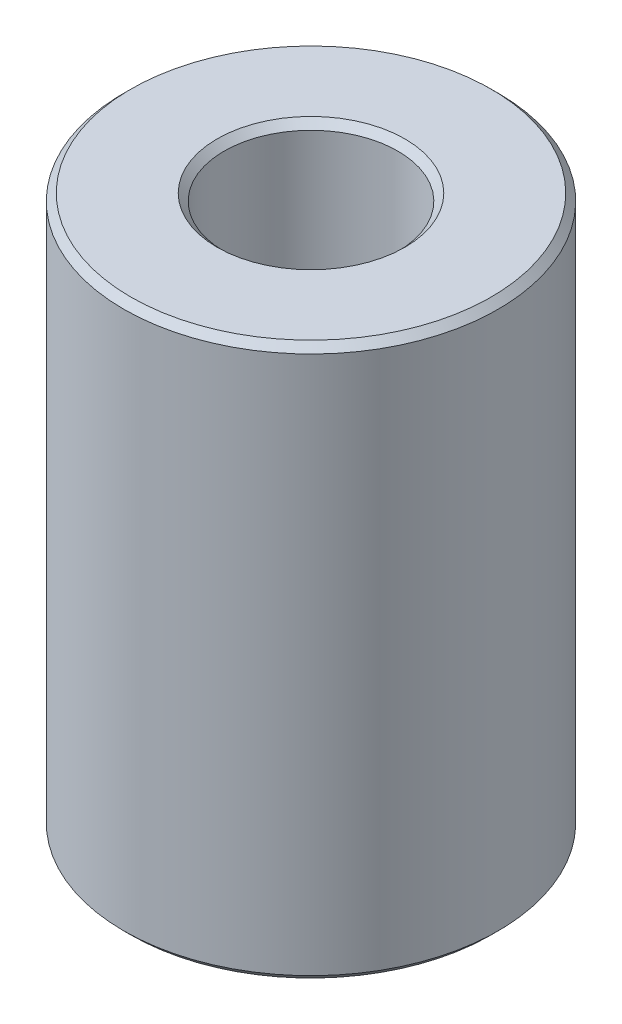
ISO-10303-21;
HEADER;
FILE_DESCRIPTION(('STEP AP214'),'2;1');
FILE_NAME('part.step','',(''),(''),'','','');
FILE_SCHEMA(('AUTOMOTIVE_DESIGN { 1 0 10303 214 1 1 1 1 }'));
ENDSEC;
DATA;
#1=APPLICATION_CONTEXT('core data for automotive mechanical design processes');
#2=APPLICATION_PROTOCOL_DEFINITION('international standard','automotive_design',2000,#1);
#3=PRODUCT_CONTEXT('',#1,'mechanical');
#4=PRODUCT('Part','Part','',(#3));
#5=PRODUCT_RELATED_PRODUCT_CATEGORY('part','',(#4));
#6=PRODUCT_DEFINITION_FORMATION('','',#4);
#7=PRODUCT_DEFINITION_CONTEXT('part definition',#1,'design');
#8=PRODUCT_DEFINITION('design','',#6,#7);
#9=PRODUCT_DEFINITION_SHAPE('','',#8);
#10=(LENGTH_UNIT() NAMED_UNIT(*) SI_UNIT(.MILLI.,.METRE.));
#11=(NAMED_UNIT(*) PLANE_ANGLE_UNIT() SI_UNIT($,.RADIAN.));
#12=(NAMED_UNIT(*) SI_UNIT($,.STERADIAN.) SOLID_ANGLE_UNIT());
#13=UNCERTAINTY_MEASURE_WITH_UNIT(LENGTH_MEASURE(1.E-05),#10,'distance_accuracy_value','');
#14=(GEOMETRIC_REPRESENTATION_CONTEXT(3) GLOBAL_UNCERTAINTY_ASSIGNED_CONTEXT((#13)) GLOBAL_UNIT_ASSIGNED_CONTEXT((#10,
#11,#12)) REPRESENTATION_CONTEXT('',''));
#15=CARTESIAN_POINT('',(0.,0.,0.));
#16=DIRECTION('',(0.,0.,1.));
#17=DIRECTION('',(1.,0.,0.));
#18=AXIS2_PLACEMENT_3D('',#15,#16,#17);
#19=CARTESIAN_POINT('',(0.,140.190415541771,0.));
#20=DIRECTION('',(0.,-1.,0.));
#21=DIRECTION('',(0.,0.,-1.));
#22=AXIS2_PLACEMENT_3D('',#19,#20,#21);
#23=CYLINDRICAL_SURFACE('',#22,47.5);
#24=CARTESIAN_POINT('',(0.,1.78519421544657,0.));
#25=DIRECTION('',(0.,1.,0.));
#26=DIRECTION('',(0.,0.,1.));
#27=AXIS2_PLACEMENT_3D('',#24,#25,#26);
#28=CIRCLE('',#27,47.5);
#29=CARTESIAN_POINT('',(0.,1.78519421544657,47.5));
#30=VERTEX_POINT('',#29);
#31=EDGE_CURVE('E10',#30,#30,#28,.T.);
#32=ORIENTED_EDGE('',*,*,#31,.T.);
#33=EDGE_LOOP('',(#32));
#34=FACE_BOUND('',#33,.T.);
#35=CARTESIAN_POINT('',(0.,138.405221326324,0.));
#36=DIRECTION('',(0.,1.,0.));
#37=DIRECTION('',(0.,0.,1.));
#38=AXIS2_PLACEMENT_3D('',#35,#36,#37);
#39=CIRCLE('',#38,47.5);
#40=CARTESIAN_POINT('',(0.,138.405221326324,47.5));
#41=VERTEX_POINT('',#40);
#42=EDGE_CURVE('E50',#41,#41,#39,.F.);
#43=ORIENTED_EDGE('',*,*,#42,.T.);
#44=EDGE_LOOP('',(#43));
#45=FACE_BOUND('',#44,.T.);
#46=ADVANCED_FACE('F39',(#34,#45),#23,.T.);
#47=CARTESIAN_POINT('',(0.,140.190415541771,0.));
#48=DIRECTION('',(0.,1.,0.));
#49=DIRECTION('',(0.,0.,1.));
#50=AXIS2_PLACEMENT_3D('',#47,#48,#49);
#51=PLANE('',#50);
#52=CARTESIAN_POINT('',(0.,140.190415541771,0.));
#53=DIRECTION('',(0.,1.,0.));
#54=DIRECTION('',(0.,0.,1.));
#55=AXIS2_PLACEMENT_3D('',#52,#53,#54);
#56=CIRCLE('',#55,23.8303781244977);
#57=CARTESIAN_POINT('',(0.,140.190415541771,23.8303781244977));
#58=VERTEX_POINT('',#57);
#59=EDGE_CURVE('E58',#58,#58,#56,.F.);
#60=ORIENTED_EDGE('',*,*,#59,.T.);
#61=EDGE_LOOP('',(#60));
#62=FACE_BOUND('',#61,.T.);
#63=CARTESIAN_POINT('',(0.,140.190415541771,0.));
#64=DIRECTION('',(0.,1.,0.));
#65=DIRECTION('',(0.,0.,1.));
#66=AXIS2_PLACEMENT_3D('',#63,#64,#65);
#67=CIRCLE('',#66,45.7148057845534);
#68=CARTESIAN_POINT('',(0.,140.190415541771,45.7148057845534));
#69=VERTEX_POINT('',#68);
#70=EDGE_CURVE('E61',#69,#69,#67,.T.);
#71=ORIENTED_EDGE('',*,*,#70,.T.);
#72=EDGE_LOOP('',(#71));
#73=FACE_BOUND('',#72,.T.);
#74=ADVANCED_FACE('F88',(#62,#73),#51,.T.);
#75=CARTESIAN_POINT('',(0.,0.,0.));
#76=DIRECTION('',(0.,1.,0.));
#77=DIRECTION('',(0.,0.,1.));
#78=AXIS2_PLACEMENT_3D('',#75,#76,#77);
#79=PLANE('',#78);
#80=CARTESIAN_POINT('',(0.,0.,0.));
#81=DIRECTION('',(0.,1.,0.));
#82=DIRECTION('',(0.,0.,1.));
#83=AXIS2_PLACEMENT_3D('',#80,#81,#82);
#84=CIRCLE('',#83,23.8303781244977);
#85=CARTESIAN_POINT('',(0.,0.,23.8303781244977));
#86=VERTEX_POINT('',#85);
#87=EDGE_CURVE('E51',#86,#86,#84,.T.);
#88=ORIENTED_EDGE('',*,*,#87,.T.);
#89=EDGE_LOOP('',(#88));
#90=FACE_BOUND('',#89,.T.);
#91=CARTESIAN_POINT('',(0.,0.,0.));
#92=DIRECTION('',(0.,1.,0.));
#93=DIRECTION('',(0.,0.,1.));
#94=AXIS2_PLACEMENT_3D('',#91,#92,#93);
#95=CIRCLE('',#94,45.7148057845534);
#96=CARTESIAN_POINT('',(0.,0.,45.7148057845534));
#97=VERTEX_POINT('',#96);
#98=EDGE_CURVE('E54',#97,#97,#95,.F.);
#99=ORIENTED_EDGE('',*,*,#98,.T.);
#100=EDGE_LOOP('',(#99));
#101=FACE_BOUND('',#100,.T.);
#102=ADVANCED_FACE('F83',(#90,#101),#79,.F.);
#103=CARTESIAN_POINT('',(0.,140.190415541771,0.));
#104=DIRECTION('',(0.,-1.,0.));
#105=DIRECTION('',(0.,0.,-1.));
#106=AXIS2_PLACEMENT_3D('',#103,#104,#105);
#107=CYLINDRICAL_SURFACE('',#106,22.0451839090511);
#108=CARTESIAN_POINT('',(0.,138.405221326324,0.));
#109=DIRECTION('',(0.,1.,0.));
#110=DIRECTION('',(0.,0.,1.));
#111=AXIS2_PLACEMENT_3D('',#108,#109,#110);
#112=CIRCLE('',#111,22.0451839090511);
#113=CARTESIAN_POINT('',(0.,138.405221326324,22.0451839090511));
#114=VERTEX_POINT('',#113);
#115=EDGE_CURVE('E67',#114,#114,#112,.T.);
#116=ORIENTED_EDGE('',*,*,#115,.T.);
#117=EDGE_LOOP('',(#116));
#118=FACE_BOUND('',#117,.T.);
#119=CARTESIAN_POINT('',(0.,1.78519421544659,0.));
#120=DIRECTION('',(0.,1.,0.));
#121=DIRECTION('',(0.,0.,1.));
#122=AXIS2_PLACEMENT_3D('',#119,#120,#121);
#123=CIRCLE('',#122,22.0451839090511);
#124=CARTESIAN_POINT('',(0.,1.78519421544659,22.0451839090511));
#125=VERTEX_POINT('',#124);
#126=EDGE_CURVE('E69',#125,#125,#123,.F.);
#127=ORIENTED_EDGE('',*,*,#126,.T.);
#128=EDGE_LOOP('',(#127));
#129=FACE_BOUND('',#128,.T.);
#130=ADVANCED_FACE('F71',(#118,#129),#107,.F.);
#131=CARTESIAN_POINT('',(0.,138.405221326324,0.));
#132=DIRECTION('',(0.,1.,0.));
#133=DIRECTION('',(0.,0.,1.));
#134=AXIS2_PLACEMENT_3D('',#131,#132,#133);
#135=CONICAL_SURFACE('',#134,22.0451839090511,0.785398163397457);
#136=ORIENTED_EDGE('',*,*,#59,.F.);
#137=EDGE_LOOP('',(#136));
#138=FACE_BOUND('',#137,.T.);
#139=ORIENTED_EDGE('',*,*,#115,.F.);
#140=EDGE_LOOP('',(#139));
#141=FACE_BOUND('',#140,.T.);
#142=ADVANCED_FACE('F77',(#138,#141),#135,.F.);
#143=CARTESIAN_POINT('',(0.,0.,0.));
#144=DIRECTION('',(0.,-1.,0.));
#145=DIRECTION('',(0.,0.,-1.));
#146=AXIS2_PLACEMENT_3D('',#143,#144,#145);
#147=CONICAL_SURFACE('',#146,23.8303781244977,0.785398163397445);
#148=ORIENTED_EDGE('',*,*,#126,.F.);
#149=EDGE_LOOP('',(#148));
#150=FACE_BOUND('',#149,.T.);
#151=ORIENTED_EDGE('',*,*,#87,.F.);
#152=EDGE_LOOP('',(#151));
#153=FACE_BOUND('',#152,.T.);
#154=ADVANCED_FACE('F73',(#150,#153),#147,.F.);
#155=CARTESIAN_POINT('',(0.,1.78519421544657,0.));
#156=DIRECTION('',(0.,1.,0.));
#157=DIRECTION('',(0.,0.,1.));
#158=AXIS2_PLACEMENT_3D('',#155,#156,#157);
#159=CONICAL_SURFACE('',#158,47.5,0.785398163397446);
#160=ORIENTED_EDGE('',*,*,#98,.F.);
#161=EDGE_LOOP('',(#160));
#162=FACE_BOUND('',#161,.T.);
#163=ORIENTED_EDGE('',*,*,#31,.F.);
#164=EDGE_LOOP('',(#163));
#165=FACE_BOUND('',#164,.T.);
#166=ADVANCED_FACE('F76',(#162,#165),#159,.T.);
#167=CARTESIAN_POINT('',(0.,140.190415541771,0.));
#168=DIRECTION('',(0.,-1.,0.));
#169=DIRECTION('',(0.,0.,-1.));
#170=AXIS2_PLACEMENT_3D('',#167,#168,#169);
#171=CONICAL_SURFACE('',#170,45.7148057845534,0.785398163397448);
#172=ORIENTED_EDGE('',*,*,#42,.F.);
#173=EDGE_LOOP('',(#172));
#174=FACE_BOUND('',#173,.T.);
#175=ORIENTED_EDGE('',*,*,#70,.F.);
#176=EDGE_LOOP('',(#175));
#177=FACE_BOUND('',#176,.T.);
#178=ADVANCED_FACE('F45',(#174,#177),#171,.T.);
#179=CLOSED_SHELL('',(#46,#74,#102,#130,#142,#154,#166,#178));
#180=MANIFOLD_SOLID_BREP('B2',#179);
#181=ADVANCED_BREP_SHAPE_REPRESENTATION('',(#18,#180),#14);
#182=SHAPE_DEFINITION_REPRESENTATION(#9,#181);
ENDSEC;
END-ISO-10303-21;
